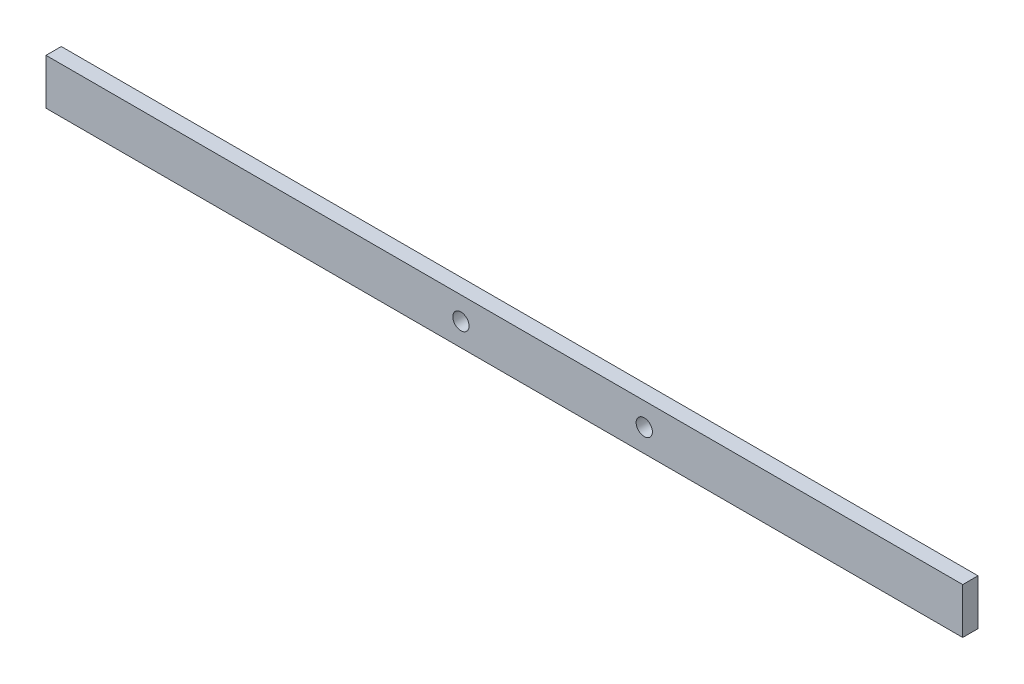
ISO-10303-21;
HEADER;
FILE_DESCRIPTION(('STEP AP214'),'2;1');
FILE_NAME('part.step','',(''),(''),'','','');
FILE_SCHEMA(('AUTOMOTIVE_DESIGN { 1 0 10303 214 1 1 1 1 }'));
ENDSEC;
DATA;
#1=APPLICATION_CONTEXT('core data for automotive mechanical design processes');
#2=APPLICATION_PROTOCOL_DEFINITION('international standard','automotive_design',2000,#1);
#3=PRODUCT_CONTEXT('',#1,'mechanical');
#4=PRODUCT('Part','Part','',(#3));
#5=PRODUCT_RELATED_PRODUCT_CATEGORY('part','',(#4));
#6=PRODUCT_DEFINITION_FORMATION('','',#4);
#7=PRODUCT_DEFINITION_CONTEXT('part definition',#1,'design');
#8=PRODUCT_DEFINITION('design','',#6,#7);
#9=PRODUCT_DEFINITION_SHAPE('','',#8);
#10=(LENGTH_UNIT() NAMED_UNIT(*) SI_UNIT(.MILLI.,.METRE.));
#11=(NAMED_UNIT(*) PLANE_ANGLE_UNIT() SI_UNIT($,.RADIAN.));
#12=(NAMED_UNIT(*) SI_UNIT($,.STERADIAN.) SOLID_ANGLE_UNIT());
#13=UNCERTAINTY_MEASURE_WITH_UNIT(LENGTH_MEASURE(1.E-05),#10,'distance_accuracy_value','');
#14=(GEOMETRIC_REPRESENTATION_CONTEXT(3) GLOBAL_UNCERTAINTY_ASSIGNED_CONTEXT((#13)) GLOBAL_UNIT_ASSIGNED_CONTEXT((#10,
#11,#12)) REPRESENTATION_CONTEXT('',''));
#15=CARTESIAN_POINT('',(0.,0.,0.));
#16=DIRECTION('',(0.,0.,1.));
#17=DIRECTION('',(1.,0.,0.));
#18=AXIS2_PLACEMENT_3D('',#15,#16,#17);
#19=CARTESIAN_POINT('',(190.5,-9.525,6.35));
#20=DIRECTION('',(-1.,0.,0.));
#21=DIRECTION('',(0.,0.,1.));
#22=AXIS2_PLACEMENT_3D('',#19,#20,#21);
#23=PLANE('',#22);
#24=DIRECTION('',(0.,1.,0.));
#25=VECTOR('',#24,1.);
#26=CARTESIAN_POINT('',(190.5,-9.525,0.));
#27=LINE('',#26,#25);
#28=CARTESIAN_POINT('',(190.5,-9.525,0.));
#29=VERTEX_POINT('',#28);
#30=CARTESIAN_POINT('',(190.5,9.525,0.));
#31=VERTEX_POINT('',#30);
#32=EDGE_CURVE('E102',#29,#31,#27,.T.);
#33=ORIENTED_EDGE('',*,*,#32,.T.);
#34=DIRECTION('',(0.,0.,-1.));
#35=VECTOR('',#34,1.);
#36=CARTESIAN_POINT('',(190.5,9.525,6.35));
#37=LINE('',#36,#35);
#38=CARTESIAN_POINT('',(190.5,9.525,6.35));
#39=VERTEX_POINT('',#38);
#40=EDGE_CURVE('E11',#39,#31,#37,.T.);
#41=ORIENTED_EDGE('',*,*,#40,.F.);
#42=DIRECTION('',(0.,1.,0.));
#43=VECTOR('',#42,1.);
#44=CARTESIAN_POINT('',(190.5,-9.525,6.35));
#45=LINE('',#44,#43);
#46=CARTESIAN_POINT('',(190.5,-9.525,6.35));
#47=VERTEX_POINT('',#46);
#48=EDGE_CURVE('E90',#47,#39,#45,.T.);
#49=ORIENTED_EDGE('',*,*,#48,.F.);
#50=DIRECTION('',(0.,0.,-1.));
#51=VECTOR('',#50,1.);
#52=CARTESIAN_POINT('',(190.5,-9.525,6.35));
#53=LINE('',#52,#51);
#54=EDGE_CURVE('E98',#47,#29,#53,.T.);
#55=ORIENTED_EDGE('',*,*,#54,.T.);
#56=EDGE_LOOP('',(#33,#41,#49,#55));
#57=FACE_BOUND('',#56,.T.);
#58=ADVANCED_FACE('F39',(#57),#23,.F.);
#59=CARTESIAN_POINT('',(-190.5,9.525,6.35));
#60=DIRECTION('',(0.,-1.,0.));
#61=DIRECTION('',(0.,0.,-1.));
#62=AXIS2_PLACEMENT_3D('',#59,#60,#61);
#63=PLANE('',#62);
#64=DIRECTION('',(-1.,0.,0.));
#65=VECTOR('',#64,1.);
#66=CARTESIAN_POINT('',(-190.5,9.525,0.));
#67=LINE('',#66,#65);
#68=CARTESIAN_POINT('',(-190.5,9.525,0.));
#69=VERTEX_POINT('',#68);
#70=EDGE_CURVE('E94',#31,#69,#67,.T.);
#71=ORIENTED_EDGE('',*,*,#70,.T.);
#72=DIRECTION('',(0.,0.,-1.));
#73=VECTOR('',#72,1.);
#74=CARTESIAN_POINT('',(-190.5,9.525,6.35));
#75=LINE('',#74,#73);
#76=CARTESIAN_POINT('',(-190.5,9.525,6.35));
#77=VERTEX_POINT('',#76);
#78=EDGE_CURVE('E47',#77,#69,#75,.T.);
#79=ORIENTED_EDGE('',*,*,#78,.F.);
#80=DIRECTION('',(-1.,0.,0.));
#81=VECTOR('',#80,1.);
#82=CARTESIAN_POINT('',(-190.5,9.525,6.35));
#83=LINE('',#82,#81);
#84=EDGE_CURVE('E85',#39,#77,#83,.T.);
#85=ORIENTED_EDGE('',*,*,#84,.F.);
#86=ORIENTED_EDGE('',*,*,#40,.T.);
#87=EDGE_LOOP('',(#71,#79,#85,#86));
#88=FACE_BOUND('',#87,.T.);
#89=ADVANCED_FACE('F93',(#88),#63,.F.);
#90=CARTESIAN_POINT('',(-190.5,-9.525,6.35));
#91=DIRECTION('',(1.,0.,0.));
#92=DIRECTION('',(0.,0.,-1.));
#93=AXIS2_PLACEMENT_3D('',#90,#91,#92);
#94=PLANE('',#93);
#95=DIRECTION('',(0.,-1.,0.));
#96=VECTOR('',#95,1.);
#97=CARTESIAN_POINT('',(-190.5,-9.525,0.));
#98=LINE('',#97,#96);
#99=CARTESIAN_POINT('',(-190.5,-9.525,0.));
#100=VERTEX_POINT('',#99);
#101=EDGE_CURVE('E72',#69,#100,#98,.T.);
#102=ORIENTED_EDGE('',*,*,#101,.T.);
#103=DIRECTION('',(0.,0.,-1.));
#104=VECTOR('',#103,1.);
#105=CARTESIAN_POINT('',(-190.5,-9.525,6.35));
#106=LINE('',#105,#104);
#107=CARTESIAN_POINT('',(-190.5,-9.525,6.35));
#108=VERTEX_POINT('',#107);
#109=EDGE_CURVE('E95',#108,#100,#106,.T.);
#110=ORIENTED_EDGE('',*,*,#109,.F.);
#111=DIRECTION('',(0.,-1.,0.));
#112=VECTOR('',#111,1.);
#113=CARTESIAN_POINT('',(-190.5,-9.525,6.35));
#114=LINE('',#113,#112);
#115=EDGE_CURVE('E88',#77,#108,#114,.T.);
#116=ORIENTED_EDGE('',*,*,#115,.F.);
#117=ORIENTED_EDGE('',*,*,#78,.T.);
#118=EDGE_LOOP('',(#102,#110,#116,#117));
#119=FACE_BOUND('',#118,.T.);
#120=ADVANCED_FACE('F96',(#119),#94,.F.);
#121=CARTESIAN_POINT('',(-190.5,-9.525,6.35));
#122=DIRECTION('',(0.,1.,0.));
#123=DIRECTION('',(0.,0.,1.));
#124=AXIS2_PLACEMENT_3D('',#121,#122,#123);
#125=PLANE('',#124);
#126=DIRECTION('',(1.,0.,0.));
#127=VECTOR('',#126,1.);
#128=CARTESIAN_POINT('',(-190.5,-9.525,0.));
#129=LINE('',#128,#127);
#130=EDGE_CURVE('E78',#100,#29,#129,.T.);
#131=ORIENTED_EDGE('',*,*,#130,.T.);
#132=ORIENTED_EDGE('',*,*,#54,.F.);
#133=DIRECTION('',(1.,0.,0.));
#134=VECTOR('',#133,1.);
#135=CARTESIAN_POINT('',(-190.5,-9.525,6.35));
#136=LINE('',#135,#134);
#137=EDGE_CURVE('E55',#108,#47,#136,.T.);
#138=ORIENTED_EDGE('',*,*,#137,.F.);
#139=ORIENTED_EDGE('',*,*,#109,.T.);
#140=EDGE_LOOP('',(#131,#132,#138,#139));
#141=FACE_BOUND('',#140,.T.);
#142=ADVANCED_FACE('F110',(#141),#125,.F.);
#143=CARTESIAN_POINT('',(190.5,9.525,6.35));
#144=DIRECTION('',(0.,0.,-1.));
#145=DIRECTION('',(-1.,0.,0.));
#146=AXIS2_PLACEMENT_3D('',#143,#144,#145);
#147=PLANE('',#146);
#148=CARTESIAN_POINT('',(-18.0467,0.,6.35));
#149=DIRECTION('',(0.,0.,1.));
#150=DIRECTION('',(1.,0.,0.));
#151=AXIS2_PLACEMENT_3D('',#148,#149,#150);
#152=CIRCLE('',#151,3.37819999999998);
#153=CARTESIAN_POINT('',(-14.6685,0.,6.35));
#154=VERTEX_POINT('',#153);
#155=EDGE_CURVE('E124',#154,#154,#152,.T.);
#156=ORIENTED_EDGE('',*,*,#155,.F.);
#157=EDGE_LOOP('',(#156));
#158=FACE_BOUND('',#157,.T.);
#159=CARTESIAN_POINT('',(58.1533,0.,6.35));
#160=DIRECTION('',(0.,0.,1.));
#161=DIRECTION('',(1.,0.,0.));
#162=AXIS2_PLACEMENT_3D('',#159,#160,#161);
#163=CIRCLE('',#162,3.37819999999998);
#164=CARTESIAN_POINT('',(61.5315,0.,6.35));
#165=VERTEX_POINT('',#164);
#166=EDGE_CURVE('E118',#165,#165,#163,.T.);
#167=ORIENTED_EDGE('',*,*,#166,.F.);
#168=EDGE_LOOP('',(#167));
#169=FACE_BOUND('',#168,.T.);
#170=ORIENTED_EDGE('',*,*,#48,.T.);
#171=ORIENTED_EDGE('',*,*,#84,.T.);
#172=ORIENTED_EDGE('',*,*,#115,.T.);
#173=ORIENTED_EDGE('',*,*,#137,.T.);
#174=EDGE_LOOP('',(#170,#171,#172,#173));
#175=FACE_BOUND('',#174,.T.);
#176=ADVANCED_FACE('F86',(#158,#169,#175),#147,.F.);
#177=CARTESIAN_POINT('',(190.5,9.525,0.));
#178=DIRECTION('',(0.,0.,-1.));
#179=DIRECTION('',(-1.,0.,0.));
#180=AXIS2_PLACEMENT_3D('',#177,#178,#179);
#181=PLANE('',#180);
#182=CARTESIAN_POINT('',(-18.0467,0.,0.));
#183=DIRECTION('',(0.,0.,1.));
#184=DIRECTION('',(1.,0.,0.));
#185=AXIS2_PLACEMENT_3D('',#182,#183,#184);
#186=CIRCLE('',#185,3.37819999999998);
#187=CARTESIAN_POINT('',(-14.6685,0.,0.));
#188=VERTEX_POINT('',#187);
#189=EDGE_CURVE('E121',#188,#188,#186,.T.);
#190=ORIENTED_EDGE('',*,*,#189,.T.);
#191=EDGE_LOOP('',(#190));
#192=FACE_BOUND('',#191,.T.);
#193=CARTESIAN_POINT('',(58.1533,0.,0.));
#194=DIRECTION('',(0.,0.,1.));
#195=DIRECTION('',(1.,0.,0.));
#196=AXIS2_PLACEMENT_3D('',#193,#194,#195);
#197=CIRCLE('',#196,3.37819999999998);
#198=CARTESIAN_POINT('',(61.5315,0.,0.));
#199=VERTEX_POINT('',#198);
#200=EDGE_CURVE('E105',#199,#199,#197,.T.);
#201=ORIENTED_EDGE('',*,*,#200,.T.);
#202=EDGE_LOOP('',(#201));
#203=FACE_BOUND('',#202,.T.);
#204=ORIENTED_EDGE('',*,*,#32,.F.);
#205=ORIENTED_EDGE('',*,*,#130,.F.);
#206=ORIENTED_EDGE('',*,*,#101,.F.);
#207=ORIENTED_EDGE('',*,*,#70,.F.);
#208=EDGE_LOOP('',(#204,#205,#206,#207));
#209=FACE_BOUND('',#208,.T.);
#210=ADVANCED_FACE('F113',(#192,#203,#209),#181,.T.);
#211=CARTESIAN_POINT('',(58.1533,0.,6.35));
#212=DIRECTION('',(0.,0.,1.));
#213=DIRECTION('',(1.,0.,0.));
#214=AXIS2_PLACEMENT_3D('',#211,#212,#213);
#215=CYLINDRICAL_SURFACE('',#214,3.37819999999998);
#216=ORIENTED_EDGE('',*,*,#200,.F.);
#217=EDGE_LOOP('',(#216));
#218=FACE_BOUND('',#217,.T.);
#219=ORIENTED_EDGE('',*,*,#166,.T.);
#220=EDGE_LOOP('',(#219));
#221=FACE_BOUND('',#220,.T.);
#222=ADVANCED_FACE('F135',(#218,#221),#215,.F.);
#223=CARTESIAN_POINT('',(-18.0467,0.,6.35));
#224=DIRECTION('',(0.,0.,1.));
#225=DIRECTION('',(1.,0.,0.));
#226=AXIS2_PLACEMENT_3D('',#223,#224,#225);
#227=CYLINDRICAL_SURFACE('',#226,3.37819999999998);
#228=ORIENTED_EDGE('',*,*,#189,.F.);
#229=EDGE_LOOP('',(#228));
#230=FACE_BOUND('',#229,.T.);
#231=ORIENTED_EDGE('',*,*,#155,.T.);
#232=EDGE_LOOP('',(#231));
#233=FACE_BOUND('',#232,.T.);
#234=ADVANCED_FACE('F128',(#230,#233),#227,.F.);
#235=CLOSED_SHELL('',(#58,#89,#120,#142,#176,#210,#222,#234));
#236=MANIFOLD_SOLID_BREP('B2',#235);
#237=ADVANCED_BREP_SHAPE_REPRESENTATION('',(#18,#236),#14);
#238=SHAPE_DEFINITION_REPRESENTATION(#9,#237);
ENDSEC;
END-ISO-10303-21;
